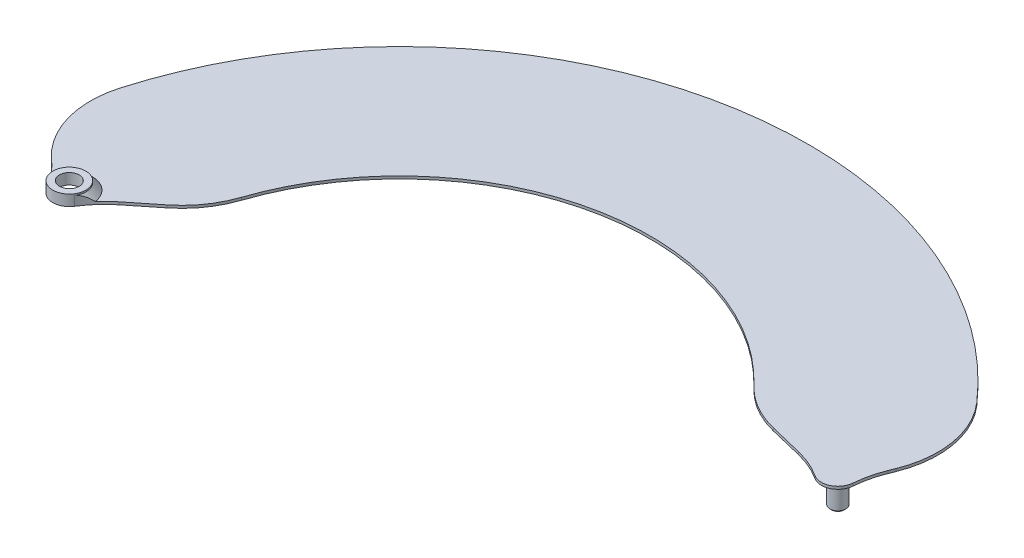
ISO-10303-21;
HEADER;
FILE_DESCRIPTION(('STEP AP214'),'2;1');
FILE_NAME('part.step','',(''),(''),'','','');
FILE_SCHEMA(('AUTOMOTIVE_DESIGN { 1 0 10303 214 1 1 1 1 }'));
ENDSEC;
DATA;
#1=APPLICATION_CONTEXT('core data for automotive mechanical design processes');
#2=APPLICATION_PROTOCOL_DEFINITION('international standard','automotive_design',2000,#1);
#3=PRODUCT_CONTEXT('',#1,'mechanical');
#4=PRODUCT('Part','Part','',(#3));
#5=PRODUCT_RELATED_PRODUCT_CATEGORY('part','',(#4));
#6=PRODUCT_DEFINITION_FORMATION('','',#4);
#7=PRODUCT_DEFINITION_CONTEXT('part definition',#1,'design');
#8=PRODUCT_DEFINITION('design','',#6,#7);
#9=PRODUCT_DEFINITION_SHAPE('','',#8);
#10=(LENGTH_UNIT() NAMED_UNIT(*) SI_UNIT(.MILLI.,.METRE.));
#11=(NAMED_UNIT(*) PLANE_ANGLE_UNIT() SI_UNIT($,.RADIAN.));
#12=(NAMED_UNIT(*) SI_UNIT($,.STERADIAN.) SOLID_ANGLE_UNIT());
#13=UNCERTAINTY_MEASURE_WITH_UNIT(LENGTH_MEASURE(1.E-05),#10,'distance_accuracy_value','');
#14=(GEOMETRIC_REPRESENTATION_CONTEXT(3) GLOBAL_UNCERTAINTY_ASSIGNED_CONTEXT((#13)) GLOBAL_UNIT_ASSIGNED_CONTEXT((#10,
#11,#12)) REPRESENTATION_CONTEXT('',''));
#15=CARTESIAN_POINT('',(0.,0.,0.));
#16=DIRECTION('',(0.,0.,1.));
#17=DIRECTION('',(1.,0.,0.));
#18=AXIS2_PLACEMENT_3D('',#15,#16,#17);
#19=CARTESIAN_POINT('',(22.6576946759163,0.2,-10.5654565435173));
#20=DIRECTION('',(0.,1.,0.));
#21=DIRECTION('',(0.,0.,1.));
#22=AXIS2_PLACEMENT_3D('',#19,#20,#21);
#23=PLANE('',#22);
#24=CARTESIAN_POINT('',(-64.638642589124,0.2,8.21403355419959));
#25=DIRECTION('',(0.,1.,0.));
#26=DIRECTION('',(0.,0.,1.));
#27=AXIS2_PLACEMENT_3D('',#24,#25,#26);
#28=CIRCLE('',#27,14.2857142857143);
#29=CARTESIAN_POINT('',(-54.8963953684509,0.2,-2.2344233531312));
#30=VERTEX_POINT('',#29);
#31=CARTESIAN_POINT('',(-53.4384139061172,0.2,-0.653689383590762));
#32=VERTEX_POINT('',#31);
#33=EDGE_CURVE('E212',#30,#32,#28,.F.);
#34=ORIENTED_EDGE('',*,*,#33,.T.);
#35=CARTESIAN_POINT('',(-50.,0.2,0.));
#36=DIRECTION('',(0.,1.,0.));
#37=DIRECTION('',(0.,0.,1.));
#38=AXIS2_PLACEMENT_3D('',#35,#36,#37);
#39=CIRCLE('',#38,3.49999999999995);
#40=CARTESIAN_POINT('',(-46.5336779208397,0.2,-0.484366848086781));
#41=VERTEX_POINT('',#40);
#42=EDGE_CURVE('E58',#32,#41,#39,.F.);
#43=ORIENTED_EDGE('',*,*,#42,.T.);
#44=CARTESIAN_POINT('',(-35.7815709382208,0.2,8.92168588870873));
#45=DIRECTION('',(0.,1.,0.));
#46=DIRECTION('',(0.,0.,1.));
#47=AXIS2_PLACEMENT_3D('',#44,#45,#46);
#48=CIRCLE('',#47,14.2857142857143);
#49=CARTESIAN_POINT('',(-44.7014335827453,0.2,-2.23706328204856));
#50=VERTEX_POINT('',#49);
#51=EDGE_CURVE('E216',#41,#50,#48,.F.);
#52=ORIENTED_EDGE('',*,*,#51,.T.);
#53=DIRECTION('',(0.781112441953009,0.,-0.624390385116721));
#54=VECTOR('',#53,1.);
#55=CARTESIAN_POINT('',(0.458755529096928,0.2,-38.3363319110118));
#56=LINE('',#55,#54);
#57=CARTESIAN_POINT('',(-40.6489307343633,0.2,-5.47647374113847));
#58=VERTEX_POINT('',#57);
#59=EDGE_CURVE('E375',#50,#58,#56,.T.);
#60=ORIENTED_EDGE('',*,*,#59,.T.);
#61=CARTESIAN_POINT('',(-49.5687933788879,0.2,-16.6352229118957));
#62=DIRECTION('',(0.,1.,0.));
#63=DIRECTION('',(0.,0.,1.));
#64=AXIS2_PLACEMENT_3D('',#61,#62,#63);
#65=CIRCLE('',#64,14.2857142857143);
#66=CARTESIAN_POINT('',(-36.0254072097929,0.2,-12.0900800397931));
#67=VERTEX_POINT('',#66);
#68=EDGE_CURVE('E405',#58,#67,#65,.T.);
#69=ORIENTED_EDGE('',*,*,#68,.T.);
#70=CARTESIAN_POINT('',(0.,0.2,0.));
#71=DIRECTION('',(0.,-1.,0.));
#72=DIRECTION('',(0.,0.,1.));
#73=AXIS2_PLACEMENT_3D('',#70,#71,#72);
#74=CIRCLE('',#73,38.);
#75=CARTESIAN_POINT('',(27.5406184746784,0.2,-26.1823286594642));
#76=VERTEX_POINT('',#75);
#77=EDGE_CURVE('E386',#67,#76,#74,.T.);
#78=ORIENTED_EDGE('',*,*,#77,.T.);
#79=CARTESIAN_POINT('',(37.8942344426026,0.2,-36.0253093585109));
#80=DIRECTION('',(0.,1.,0.));
#81=DIRECTION('',(0.,0.,1.));
#82=AXIS2_PLACEMENT_3D('',#79,#80,#81);
#83=CIRCLE('',#82,14.2857142857143);
#84=CARTESIAN_POINT('',(34.5259846463185,0.2,-22.1423512456701));
#85=VERTEX_POINT('',#84);
#86=EDGE_CURVE('E407',#76,#85,#83,.T.);
#87=ORIENTED_EDGE('',*,*,#86,.T.);
#88=DIRECTION('',(-0.971807067898858,0.,-0.23577748573989));
#89=VECTOR('',#88,1.);
#90=CARTESIAN_POINT('',(25.9700815661834,0.2,-24.218163804669));
#91=LINE('',#90,#89);
#92=CARTESIAN_POINT('',(39.5678335520805,0.2,-20.9191100306713));
#93=VERTEX_POINT('',#92);
#94=EDGE_CURVE('E380',#93,#85,#91,.T.);
#95=ORIENTED_EDGE('',*,*,#94,.F.);
#96=CARTESIAN_POINT('',(36.1995837557964,0.2,-7.03615191783045));
#97=DIRECTION('',(0.,1.,0.));
#98=DIRECTION('',(0.,0.,1.));
#99=AXIS2_PLACEMENT_3D('',#96,#97,#98);
#100=CIRCLE('',#99,14.2857142857143);
#101=CARTESIAN_POINT('',(43.9577161779549,0.2,-19.0316933384298));
#102=VERTEX_POINT('',#101);
#103=EDGE_CURVE('E199',#93,#102,#100,.F.);
#104=ORIENTED_EDGE('',*,*,#103,.T.);
#105=CARTESIAN_POINT('',(45.3153893518326,0.2,-21.1309130870347));
#106=DIRECTION('',(0.,1.,0.));
#107=DIRECTION('',(0.,0.,1.));
#108=AXIS2_PLACEMENT_3D('',#105,#106,#107);
#109=CIRCLE('',#108,2.50000000000001);
#110=CARTESIAN_POINT('',(47.8083598724512,0.2,-20.9435685292634));
#111=VERTEX_POINT('',#110);
#112=EDGE_CURVE('E415',#111,#102,#109,.F.);
#113=ORIENTED_EDGE('',*,*,#112,.F.);
#114=CARTESIAN_POINT('',(62.0539057045577,0.2,-19.8730281991421));
#115=DIRECTION('',(0.,1.,0.));
#116=DIRECTION('',(0.,0.,1.));
#117=AXIS2_PLACEMENT_3D('',#114,#115,#116);
#118=CIRCLE('',#117,14.2857142857143);
#119=CARTESIAN_POINT('',(48.8087224891767,0.2,-25.2252944709239));
#120=VERTEX_POINT('',#119);
#121=EDGE_CURVE('E200',#111,#120,#118,.F.);
#122=ORIENTED_EDGE('',*,*,#121,.T.);
#123=DIRECTION('',(0.374658639024727,0.,-0.927162825076663));
#124=VECTOR('',#123,1.);
#125=CARTESIAN_POINT('',(40.0455448781668,0.2,-3.5391736553932));
#126=LINE('',#125,#124);
#127=CARTESIAN_POINT('',(49.1506503034018,0.2,-26.0714587527204));
#128=VERTEX_POINT('',#127);
#129=EDGE_CURVE('E177',#120,#128,#126,.T.);
#130=ORIENTED_EDGE('',*,*,#129,.T.);
#131=CARTESIAN_POINT('',(35.9054670880209,0.2,-31.4237250245022));
#132=DIRECTION('',(0.,1.,0.));
#133=DIRECTION('',(0.,0.,1.));
#134=AXIS2_PLACEMENT_3D('',#131,#132,#133);
#135=CIRCLE('',#134,14.2857142857143);
#136=CARTESIAN_POINT('',(46.6556069347338,0.2,-40.8320259300419));
#137=VERTEX_POINT('',#136);
#138=EDGE_CURVE('E410',#128,#137,#135,.T.);
#139=ORIENTED_EDGE('',*,*,#138,.T.);
#140=CARTESIAN_POINT('',(0.,0.2,0.));
#141=DIRECTION('',(0.,1.,0.));
#142=DIRECTION('',(0.,0.,1.));
#143=AXIS2_PLACEMENT_3D('',#140,#141,#142);
#144=CIRCLE('',#143,61.9999999999999);
#145=CARTESIAN_POINT('',(-59.5406996957757,0.2,-17.2888715576652));
#146=VERTEX_POINT('',#145);
#147=EDGE_CURVE('E384',#137,#146,#144,.T.);
#148=ORIENTED_EDGE('',*,*,#147,.T.);
#149=CARTESIAN_POINT('',(-45.8216444663343,0.2,-13.3052605996778));
#150=DIRECTION('',(0.,1.,0.));
#151=DIRECTION('',(0.,0.,1.));
#152=AXIS2_PLACEMENT_3D('',#149,#150,#151);
#153=CIRCLE('',#152,14.2857142857143);
#154=CARTESIAN_POINT('',(-55.5638916870074,0.2,-2.85680369234704));
#155=VERTEX_POINT('',#154);
#156=EDGE_CURVE('E374',#146,#155,#153,.T.);
#157=ORIENTED_EDGE('',*,*,#156,.T.);
#158=DIRECTION('',(-0.731391983513155,0.,-0.681957305447118));
#159=VECTOR('',#158,1.);
#160=CARTESIAN_POINT('',(-17.5653946103506,0.2,32.573380479163));
#161=LINE('',#160,#159);
#162=EDGE_CURVE('E372',#30,#155,#161,.T.);
#163=ORIENTED_EDGE('',*,*,#162,.F.);
#164=EDGE_LOOP('',(#34,#43,#52,#60,#69,#78,#87,#95,#104,#113,#122,#130,#139,#148,#157,#163));
#165=FACE_BOUND('',#164,.T.);
#166=ADVANCED_FACE('F41',(#165),#23,.T.);
#167=CARTESIAN_POINT('',(0.,0.2,0.));
#168=DIRECTION('',(0.,-1.,0.));
#169=DIRECTION('',(0.,0.,-1.));
#170=AXIS2_PLACEMENT_3D('',#167,#168,#169);
#171=CYLINDRICAL_SURFACE('',#170,61.9999999999999);
#172=ORIENTED_EDGE('',*,*,#147,.F.);
#173=DIRECTION('',(0.,-1.,0.));
#174=VECTOR('',#173,1.);
#175=CARTESIAN_POINT('',(46.6556069347338,0.2,-40.8320259300419));
#176=LINE('',#175,#174);
#177=CARTESIAN_POINT('',(46.6556069347338,-0.2,-40.8320259300419));
#178=VERTEX_POINT('',#177);
#179=EDGE_CURVE('E318',#137,#178,#176,.T.);
#180=ORIENTED_EDGE('',*,*,#179,.T.);
#181=CARTESIAN_POINT('',(0.,-0.2,0.));
#182=DIRECTION('',(0.,1.,0.));
#183=DIRECTION('',(0.,0.,1.));
#184=AXIS2_PLACEMENT_3D('',#181,#182,#183);
#185=CIRCLE('',#184,61.9999999999999);
#186=CARTESIAN_POINT('',(-59.5406996957757,-0.2,-17.2888715576652));
#187=VERTEX_POINT('',#186);
#188=EDGE_CURVE('E378',#178,#187,#185,.T.);
#189=ORIENTED_EDGE('',*,*,#188,.T.);
#190=DIRECTION('',(0.,-1.,0.));
#191=VECTOR('',#190,1.);
#192=CARTESIAN_POINT('',(-59.5406996957757,0.2,-17.2888715576652));
#193=LINE('',#192,#191);
#194=EDGE_CURVE('E314',#187,#146,#193,.F.);
#195=ORIENTED_EDGE('',*,*,#194,.T.);
#196=EDGE_LOOP('',(#172,#180,#189,#195));
#197=FACE_BOUND('',#196,.T.);
#198=ADVANCED_FACE('F266',(#197),#171,.T.);
#199=CARTESIAN_POINT('',(0.,0.2,0.));
#200=DIRECTION('',(0.,-1.,0.));
#201=DIRECTION('',(0.,0.,-1.));
#202=AXIS2_PLACEMENT_3D('',#199,#200,#201);
#203=CYLINDRICAL_SURFACE('',#202,38.);
#204=CARTESIAN_POINT('',(0.,-0.2,0.));
#205=DIRECTION('',(0.,-1.,0.));
#206=DIRECTION('',(0.,0.,1.));
#207=AXIS2_PLACEMENT_3D('',#204,#205,#206);
#208=CIRCLE('',#207,38.);
#209=CARTESIAN_POINT('',(-36.0254072097929,-0.2,-12.0900800397931));
#210=VERTEX_POINT('',#209);
#211=CARTESIAN_POINT('',(27.5406184746784,-0.2,-26.1823286594642));
#212=VERTEX_POINT('',#211);
#213=EDGE_CURVE('E387',#210,#212,#208,.T.);
#214=ORIENTED_EDGE('',*,*,#213,.T.);
#215=DIRECTION('',(0.,-1.,0.));
#216=VECTOR('',#215,1.);
#217=CARTESIAN_POINT('',(27.5406184746784,0.2,-26.1823286594642));
#218=LINE('',#217,#216);
#219=EDGE_CURVE('E341',#212,#76,#218,.F.);
#220=ORIENTED_EDGE('',*,*,#219,.T.);
#221=ORIENTED_EDGE('',*,*,#77,.F.);
#222=DIRECTION('',(0.,-1.,0.));
#223=VECTOR('',#222,1.);
#224=CARTESIAN_POINT('',(-36.0254072097929,0.2,-12.0900800397931));
#225=LINE('',#224,#223);
#226=EDGE_CURVE('E339',#67,#210,#225,.T.);
#227=ORIENTED_EDGE('',*,*,#226,.T.);
#228=EDGE_LOOP('',(#214,#220,#221,#227));
#229=FACE_BOUND('',#228,.T.);
#230=ADVANCED_FACE('F271',(#229),#203,.F.);
#231=CARTESIAN_POINT('',(22.6576946759163,-0.2,-10.5654565435173));
#232=DIRECTION('',(0.,1.,0.));
#233=DIRECTION('',(0.,0.,1.));
#234=AXIS2_PLACEMENT_3D('',#231,#232,#233);
#235=PLANE('',#234);
#236=CARTESIAN_POINT('',(45.3153893518326,-0.2,-21.1309130870347));
#237=DIRECTION('',(0.,1.,0.));
#238=DIRECTION('',(0.,0.,1.));
#239=AXIS2_PLACEMENT_3D('',#236,#237,#238);
#240=CIRCLE('',#239,1.95);
#241=CARTESIAN_POINT('',(45.3153893518326,-0.2,-19.1809130870347));
#242=VERTEX_POINT('',#241);
#243=EDGE_CURVE('E473',#242,#242,#240,.T.);
#244=ORIENTED_EDGE('',*,*,#243,.T.);
#245=EDGE_LOOP('',(#244));
#246=FACE_BOUND('',#245,.T.);
#247=CARTESIAN_POINT('',(-50.,-0.2,0.));
#248=DIRECTION('',(0.,1.,0.));
#249=DIRECTION('',(0.,0.,1.));
#250=AXIS2_PLACEMENT_3D('',#247,#248,#249);
#251=CIRCLE('',#250,1.5);
#252=CARTESIAN_POINT('',(-50.,-0.2,1.50000000000001));
#253=VERTEX_POINT('',#252);
#254=EDGE_CURVE('E434',#253,#253,#251,.F.);
#255=ORIENTED_EDGE('',*,*,#254,.F.);
#256=EDGE_LOOP('',(#255));
#257=FACE_BOUND('',#256,.T.);
#258=ORIENTED_EDGE('',*,*,#188,.F.);
#259=CARTESIAN_POINT('',(35.9054670880209,-0.2,-31.4237250245022));
#260=DIRECTION('',(0.,1.,0.));
#261=DIRECTION('',(0.,0.,1.));
#262=AXIS2_PLACEMENT_3D('',#259,#260,#261);
#263=CIRCLE('',#262,14.2857142857143);
#264=CARTESIAN_POINT('',(49.1506503034018,-0.2,-26.0714587527204));
#265=VERTEX_POINT('',#264);
#266=EDGE_CURVE('E190',#178,#265,#263,.F.);
#267=ORIENTED_EDGE('',*,*,#266,.T.);
#268=DIRECTION('',(0.374658639024727,0.,-0.927162825076663));
#269=VECTOR('',#268,1.);
#270=CARTESIAN_POINT('',(40.0455448781668,-0.2,-3.5391736553932));
#271=LINE('',#270,#269);
#272=CARTESIAN_POINT('',(48.8087224891767,-0.2,-25.2252944709239));
#273=VERTEX_POINT('',#272);
#274=EDGE_CURVE('E174',#273,#265,#271,.T.);
#275=ORIENTED_EDGE('',*,*,#274,.F.);
#276=CARTESIAN_POINT('',(62.0539057045577,-0.2,-19.8730281991421));
#277=DIRECTION('',(0.,1.,0.));
#278=DIRECTION('',(0.,0.,1.));
#279=AXIS2_PLACEMENT_3D('',#276,#277,#278);
#280=CIRCLE('',#279,14.2857142857143);
#281=CARTESIAN_POINT('',(47.8083598724512,-0.2,-20.9435685292634));
#282=VERTEX_POINT('',#281);
#283=EDGE_CURVE('E187',#273,#282,#280,.T.);
#284=ORIENTED_EDGE('',*,*,#283,.T.);
#285=CARTESIAN_POINT('',(45.3153893518326,-0.2,-21.1309130870347));
#286=DIRECTION('',(0.,1.,0.));
#287=DIRECTION('',(0.,0.,1.));
#288=AXIS2_PLACEMENT_3D('',#285,#286,#287);
#289=CIRCLE('',#288,2.50000000000001);
#290=CARTESIAN_POINT('',(43.9577161779549,-0.2,-19.0316933384298));
#291=VERTEX_POINT('',#290);
#292=EDGE_CURVE('E391',#282,#291,#289,.F.);
#293=ORIENTED_EDGE('',*,*,#292,.T.);
#294=CARTESIAN_POINT('',(36.1995837557964,-0.2,-7.03615191783045));
#295=DIRECTION('',(0.,1.,0.));
#296=DIRECTION('',(0.,0.,1.));
#297=AXIS2_PLACEMENT_3D('',#294,#295,#296);
#298=CIRCLE('',#297,14.2857142857143);
#299=CARTESIAN_POINT('',(39.5678335520805,-0.2,-20.9191100306713));
#300=VERTEX_POINT('',#299);
#301=EDGE_CURVE('E204',#291,#300,#298,.T.);
#302=ORIENTED_EDGE('',*,*,#301,.T.);
#303=DIRECTION('',(-0.971807067898858,0.,-0.23577748573989));
#304=VECTOR('',#303,1.);
#305=CARTESIAN_POINT('',(25.9700815661834,-0.2,-24.218163804669));
#306=LINE('',#305,#304);
#307=CARTESIAN_POINT('',(34.5259846463185,-0.2,-22.1423512456701));
#308=VERTEX_POINT('',#307);
#309=EDGE_CURVE('E192',#300,#308,#306,.T.);
#310=ORIENTED_EDGE('',*,*,#309,.T.);
#311=CARTESIAN_POINT('',(37.8942344426026,-0.2,-36.0253093585109));
#312=DIRECTION('',(0.,1.,0.));
#313=DIRECTION('',(0.,0.,1.));
#314=AXIS2_PLACEMENT_3D('',#311,#312,#313);
#315=CIRCLE('',#314,14.2857142857143);
#316=EDGE_CURVE('E320',#308,#212,#315,.F.);
#317=ORIENTED_EDGE('',*,*,#316,.T.);
#318=ORIENTED_EDGE('',*,*,#213,.F.);
#319=CARTESIAN_POINT('',(-49.5687933788879,-0.2,-16.6352229118957));
#320=DIRECTION('',(0.,1.,0.));
#321=DIRECTION('',(0.,0.,1.));
#322=AXIS2_PLACEMENT_3D('',#319,#320,#321);
#323=CIRCLE('',#322,14.2857142857143);
#324=CARTESIAN_POINT('',(-40.6489307343633,-0.2,-5.47647374113847));
#325=VERTEX_POINT('',#324);
#326=EDGE_CURVE('E317',#210,#325,#323,.F.);
#327=ORIENTED_EDGE('',*,*,#326,.T.);
#328=DIRECTION('',(0.781112441953009,0.,-0.624390385116721));
#329=VECTOR('',#328,1.);
#330=CARTESIAN_POINT('',(0.458755529096928,-0.2,-38.3363319110118));
#331=LINE('',#330,#329);
#332=CARTESIAN_POINT('',(-44.7014335827453,-0.2,-2.23706328204856));
#333=VERTEX_POINT('',#332);
#334=EDGE_CURVE('E181',#333,#325,#331,.T.);
#335=ORIENTED_EDGE('',*,*,#334,.F.);
#336=CARTESIAN_POINT('',(-35.7815709382208,-0.2,8.92168588870873));
#337=DIRECTION('',(0.,1.,0.));
#338=DIRECTION('',(0.,0.,1.));
#339=AXIS2_PLACEMENT_3D('',#336,#337,#338);
#340=CIRCLE('',#339,14.2857142857143);
#341=CARTESIAN_POINT('',(-47.8823616290967,-0.2,1.32876172810556));
#342=VERTEX_POINT('',#341);
#343=EDGE_CURVE('E218',#333,#342,#340,.T.);
#344=ORIENTED_EDGE('',*,*,#343,.T.);
#345=CARTESIAN_POINT('',(-50.,-0.2,0.));
#346=DIRECTION('',(0.,1.,0.));
#347=DIRECTION('',(0.,0.,1.));
#348=AXIS2_PLACEMENT_3D('',#345,#346,#347);
#349=CIRCLE('',#348,2.5);
#350=CARTESIAN_POINT('',(-52.1802233643376,-0.2,1.22336669956165));
#351=VERTEX_POINT('',#350);
#352=EDGE_CURVE('E360',#351,#342,#349,.T.);
#353=ORIENTED_EDGE('',*,*,#352,.F.);
#354=CARTESIAN_POINT('',(-64.638642589124,-0.2,8.21403355419959));
#355=DIRECTION('',(0.,1.,0.));
#356=DIRECTION('',(0.,0.,1.));
#357=AXIS2_PLACEMENT_3D('',#354,#355,#356);
#358=CIRCLE('',#357,14.2857142857143);
#359=CARTESIAN_POINT('',(-54.8963953684509,-0.2,-2.2344233531312));
#360=VERTEX_POINT('',#359);
#361=EDGE_CURVE('E214',#351,#360,#358,.T.);
#362=ORIENTED_EDGE('',*,*,#361,.T.);
#363=DIRECTION('',(-0.731391983513155,0.,-0.681957305447118));
#364=VECTOR('',#363,1.);
#365=CARTESIAN_POINT('',(-17.5653946103506,-0.2,32.573380479163));
#366=LINE('',#365,#364);
#367=CARTESIAN_POINT('',(-55.5638916870074,-0.2,-2.85680369234704));
#368=VERTEX_POINT('',#367);
#369=EDGE_CURVE('E191',#360,#368,#366,.T.);
#370=ORIENTED_EDGE('',*,*,#369,.T.);
#371=CARTESIAN_POINT('',(-45.8216444663343,-0.2,-13.3052605996778));
#372=DIRECTION('',(0.,1.,0.));
#373=DIRECTION('',(0.,0.,1.));
#374=AXIS2_PLACEMENT_3D('',#371,#372,#373);
#375=CIRCLE('',#374,14.2857142857143);
#376=EDGE_CURVE('E311',#368,#187,#375,.F.);
#377=ORIENTED_EDGE('',*,*,#376,.T.);
#378=EDGE_LOOP('',(#258,#267,#275,#284,#293,#302,#310,#317,#318,#327,#335,#344,#353,#362,#370,#377));
#379=FACE_BOUND('',#378,.T.);
#380=ADVANCED_FACE('F185',(#246,#257,#379),#235,.F.);
#381=CARTESIAN_POINT('',(45.3153893518326,-4.2,-21.1309130870347));
#382=DIRECTION('',(0.,1.,0.));
#383=DIRECTION('',(0.,0.,1.));
#384=AXIS2_PLACEMENT_3D('',#381,#382,#383);
#385=CYLINDRICAL_SURFACE('',#384,1.2);
#386=CARTESIAN_POINT('',(45.3153893518326,-3.95000000000001,-21.1309130870347));
#387=DIRECTION('',(0.,-1.,0.));
#388=DIRECTION('',(0.,0.,-1.));
#389=AXIS2_PLACEMENT_3D('',#386,#387,#388);
#390=CIRCLE('',#389,1.2);
#391=CARTESIAN_POINT('',(45.3153893518326,-3.95000000000001,-22.3309130870347));
#392=VERTEX_POINT('',#391);
#393=EDGE_CURVE('E11',#392,#392,#390,.F.);
#394=ORIENTED_EDGE('',*,*,#393,.T.);
#395=EDGE_LOOP('',(#394));
#396=FACE_BOUND('',#395,.T.);
#397=CARTESIAN_POINT('',(45.3153893518326,-0.95,-21.1309130870347));
#398=DIRECTION('',(0.,1.,0.));
#399=DIRECTION('',(0.,0.,1.));
#400=AXIS2_PLACEMENT_3D('',#397,#398,#399);
#401=CIRCLE('',#400,1.2);
#402=CARTESIAN_POINT('',(45.3153893518326,-0.95,-19.9309130870347));
#403=VERTEX_POINT('',#402);
#404=EDGE_CURVE('E476',#403,#403,#401,.F.);
#405=ORIENTED_EDGE('',*,*,#404,.T.);
#406=EDGE_LOOP('',(#405));
#407=FACE_BOUND('',#406,.T.);
#408=ADVANCED_FACE('F276',(#396,#407),#385,.T.);
#409=CARTESIAN_POINT('',(0.,-4.2,0.));
#410=DIRECTION('',(0.,-1.,0.));
#411=DIRECTION('',(0.,0.,-1.));
#412=AXIS2_PLACEMENT_3D('',#409,#410,#411);
#413=PLANE('',#412);
#414=CARTESIAN_POINT('',(45.3153893518326,-4.2,-21.1309130870347));
#415=DIRECTION('',(0.,-1.,0.));
#416=DIRECTION('',(0.,0.,-1.));
#417=AXIS2_PLACEMENT_3D('',#414,#415,#416);
#418=CIRCLE('',#417,0.950000000000006);
#419=CARTESIAN_POINT('',(45.3153893518326,-4.2,-22.0809130870347));
#420=VERTEX_POINT('',#419);
#421=EDGE_CURVE('E51',#420,#420,#418,.T.);
#422=ORIENTED_EDGE('',*,*,#421,.T.);
#423=EDGE_LOOP('',(#422));
#424=FACE_BOUND('',#423,.T.);
#425=ADVANCED_FACE('F463',(#424),#413,.T.);
#426=CARTESIAN_POINT('',(33.194986749751,-4.2,13.4138127864188));
#427=DIRECTION('',(0.927162825076663,0.,0.374658639024727));
#428=DIRECTION('',(0.374658639024727,0.,-0.927162825076663));
#429=AXIS2_PLACEMENT_3D('',#426,#427,#428);
#430=PLANE('',#429);
#431=ORIENTED_EDGE('',*,*,#274,.T.);
#432=DIRECTION('',(0.,1.,0.));
#433=VECTOR('',#432,1.);
#434=CARTESIAN_POINT('',(49.1506503034018,0.2,-26.0714587527204));
#435=LINE('',#434,#433);
#436=EDGE_CURVE('E180',#265,#128,#435,.T.);
#437=ORIENTED_EDGE('',*,*,#436,.T.);
#438=ORIENTED_EDGE('',*,*,#129,.F.);
#439=DIRECTION('',(0.,1.,0.));
#440=VECTOR('',#439,1.);
#441=CARTESIAN_POINT('',(48.8087224891768,-4.2,-25.2252944709239));
#442=LINE('',#441,#440);
#443=EDGE_CURVE('E170',#120,#273,#442,.F.);
#444=ORIENTED_EDGE('',*,*,#443,.T.);
#445=EDGE_LOOP('',(#431,#437,#438,#444));
#446=FACE_BOUND('',#445,.T.);
#447=ADVANCED_FACE('F172',(#446),#430,.T.);
#448=CARTESIAN_POINT('',(6.99281676834165,-4.2,-28.8223819957647));
#449=DIRECTION('',(0.23577748573989,0.,-0.971807067898858));
#450=DIRECTION('',(-0.971807067898858,0.,-0.23577748573989));
#451=AXIS2_PLACEMENT_3D('',#448,#449,#450);
#452=PLANE('',#451);
#453=ORIENTED_EDGE('',*,*,#309,.F.);
#454=DIRECTION('',(0.,-1.,0.));
#455=VECTOR('',#454,1.);
#456=CARTESIAN_POINT('',(39.5678335520805,0.2,-20.9191100306713));
#457=LINE('',#456,#455);
#458=EDGE_CURVE('E335',#300,#93,#457,.F.);
#459=ORIENTED_EDGE('',*,*,#458,.T.);
#460=ORIENTED_EDGE('',*,*,#94,.T.);
#461=DIRECTION('',(0.,-1.,0.));
#462=VECTOR('',#461,1.);
#463=CARTESIAN_POINT('',(34.5259846463185,-4.2,-22.1423512456701));
#464=LINE('',#463,#462);
#465=EDGE_CURVE('E333',#85,#308,#464,.T.);
#466=ORIENTED_EDGE('',*,*,#465,.T.);
#467=EDGE_LOOP('',(#453,#459,#460,#466));
#468=FACE_BOUND('',#467,.T.);
#469=ADVANCED_FACE('F425',(#468),#452,.F.);
#470=CARTESIAN_POINT('',(45.3153893518326,-4.2,-21.1309130870347));
#471=DIRECTION('',(0.,1.,0.));
#472=DIRECTION('',(0.,0.,1.));
#473=AXIS2_PLACEMENT_3D('',#470,#471,#472);
#474=CYLINDRICAL_SURFACE('',#473,2.50000000000001);
#475=ORIENTED_EDGE('',*,*,#292,.F.);
#476=DIRECTION('',(0.,1.,0.));
#477=VECTOR('',#476,1.);
#478=CARTESIAN_POINT('',(47.8083598724512,-4.2,-20.9435685292634));
#479=LINE('',#478,#477);
#480=EDGE_CURVE('E197',#282,#111,#479,.T.);
#481=ORIENTED_EDGE('',*,*,#480,.T.);
#482=ORIENTED_EDGE('',*,*,#112,.T.);
#483=DIRECTION('',(0.,1.,0.));
#484=VECTOR('',#483,1.);
#485=CARTESIAN_POINT('',(43.9577161779549,-4.2,-19.0316933384298));
#486=LINE('',#485,#484);
#487=EDGE_CURVE('E328',#102,#291,#486,.F.);
#488=ORIENTED_EDGE('',*,*,#487,.T.);
#489=EDGE_LOOP('',(#475,#481,#482,#488));
#490=FACE_BOUND('',#489,.T.);
#491=ADVANCED_FACE('F417',(#490),#474,.T.);
#492=CARTESIAN_POINT('',(-50.,-4.2,0.));
#493=DIRECTION('',(0.,1.,0.));
#494=DIRECTION('',(0.,0.,1.));
#495=AXIS2_PLACEMENT_3D('',#492,#493,#494);
#496=CYLINDRICAL_SURFACE('',#495,2.5);
#497=CARTESIAN_POINT('',(-50.,1.19999999999996,0.));
#498=DIRECTION('',(0.,1.,0.));
#499=DIRECTION('',(0.,0.,1.));
#500=AXIS2_PLACEMENT_3D('',#497,#498,#499);
#501=CIRCLE('',#500,2.5);
#502=CARTESIAN_POINT('',(-47.8823616290967,1.19999999999996,1.32876172810556));
#503=VERTEX_POINT('',#502);
#504=CARTESIAN_POINT('',(-52.1802233643376,1.19999999999996,1.22336669956165));
#505=VERTEX_POINT('',#504);
#506=EDGE_CURVE('E220',#503,#505,#501,.T.);
#507=ORIENTED_EDGE('',*,*,#506,.T.);
#508=DIRECTION('',(0.,1.,0.));
#509=VECTOR('',#508,1.);
#510=CARTESIAN_POINT('',(-52.1802233643376,-4.2,1.22336669956165));
#511=LINE('',#510,#509);
#512=EDGE_CURVE('E206',#505,#351,#511,.F.);
#513=ORIENTED_EDGE('',*,*,#512,.T.);
#514=ORIENTED_EDGE('',*,*,#352,.T.);
#515=DIRECTION('',(0.,1.,0.));
#516=VECTOR('',#515,1.);
#517=CARTESIAN_POINT('',(-47.8823616290967,-4.2,1.32876172810556));
#518=LINE('',#517,#516);
#519=EDGE_CURVE('E354',#342,#503,#518,.T.);
#520=ORIENTED_EDGE('',*,*,#519,.T.);
#521=EDGE_LOOP('',(#507,#513,#514,#520));
#522=FACE_BOUND('',#521,.T.);
#523=CARTESIAN_POINT('',(-50.,1.45,0.));
#524=DIRECTION('',(0.,1.,0.));
#525=DIRECTION('',(0.,0.,1.));
#526=AXIS2_PLACEMENT_3D('',#523,#524,#525);
#527=CIRCLE('',#526,2.5);
#528=CARTESIAN_POINT('',(-50.,1.45,2.50000000000001));
#529=VERTEX_POINT('',#528);
#530=EDGE_CURVE('E429',#529,#529,#527,.T.);
#531=ORIENTED_EDGE('',*,*,#530,.F.);
#532=EDGE_LOOP('',(#531));
#533=FACE_BOUND('',#532,.T.);
#534=ADVANCED_FACE('F358',(#522,#533),#496,.T.);
#535=CARTESIAN_POINT('',(-18.5185092687448,-4.2,-23.1666571763988));
#536=DIRECTION('',(0.624390385116721,0.,0.781112441953009));
#537=DIRECTION('',(0.781112441953009,0.,-0.624390385116721));
#538=AXIS2_PLACEMENT_3D('',#535,#536,#537);
#539=PLANE('',#538);
#540=ORIENTED_EDGE('',*,*,#334,.T.);
#541=DIRECTION('',(0.,1.,0.));
#542=VECTOR('',#541,1.);
#543=CARTESIAN_POINT('',(-40.6489307343633,0.2,-5.47647374113846));
#544=LINE('',#543,#542);
#545=EDGE_CURVE('E347',#325,#58,#544,.T.);
#546=ORIENTED_EDGE('',*,*,#545,.T.);
#547=ORIENTED_EDGE('',*,*,#59,.F.);
#548=DIRECTION('',(0.,-1.,0.));
#549=VECTOR('',#548,1.);
#550=CARTESIAN_POINT('',(-44.7014335827453,-0.2,-2.23706328204854));
#551=LINE('',#550,#549);
#552=EDGE_CURVE('E345',#50,#333,#551,.T.);
#553=ORIENTED_EDGE('',*,*,#552,.T.);
#554=EDGE_LOOP('',(#540,#546,#547,#553));
#555=FACE_BOUND('',#554,.T.);
#556=ADVANCED_FACE('F449',(#555),#539,.T.);
#557=CARTESIAN_POINT('',(-24.4159527387664,-4.2,26.1858505808683));
#558=DIRECTION('',(0.681957305447118,0.,-0.731391983513155));
#559=DIRECTION('',(-0.731391983513155,0.,-0.681957305447118));
#560=AXIS2_PLACEMENT_3D('',#557,#558,#559);
#561=PLANE('',#560);
#562=ORIENTED_EDGE('',*,*,#162,.T.);
#563=DIRECTION('',(0.,-1.,0.));
#564=VECTOR('',#563,1.);
#565=CARTESIAN_POINT('',(-55.5638916870074,-4.2,-2.85680369234704));
#566=LINE('',#565,#564);
#567=EDGE_CURVE('E312',#155,#368,#566,.T.);
#568=ORIENTED_EDGE('',*,*,#567,.T.);
#569=ORIENTED_EDGE('',*,*,#369,.F.);
#570=DIRECTION('',(0.,1.,0.));
#571=VECTOR('',#570,1.);
#572=CARTESIAN_POINT('',(-54.8963953684509,-4.2,-2.23442335313119));
#573=LINE('',#572,#571);
#574=EDGE_CURVE('E350',#360,#30,#573,.T.);
#575=ORIENTED_EDGE('',*,*,#574,.T.);
#576=EDGE_LOOP('',(#562,#568,#569,#575));
#577=FACE_BOUND('',#576,.T.);
#578=ADVANCED_FACE('F287',(#577),#561,.F.);
#579=CARTESIAN_POINT('',(35.9054670880209,0.2,-31.4237250245022));
#580=DIRECTION('',(0.,-1.,0.));
#581=DIRECTION('',(0.,0.,-1.));
#582=AXIS2_PLACEMENT_3D('',#579,#580,#581);
#583=CYLINDRICAL_SURFACE('',#582,14.2857142857143);
#584=ORIENTED_EDGE('',*,*,#266,.F.);
#585=ORIENTED_EDGE('',*,*,#179,.F.);
#586=ORIENTED_EDGE('',*,*,#138,.F.);
#587=ORIENTED_EDGE('',*,*,#436,.F.);
#588=EDGE_LOOP('',(#584,#585,#586,#587));
#589=FACE_BOUND('',#588,.T.);
#590=ADVANCED_FACE('F284',(#589),#583,.T.);
#591=CARTESIAN_POINT('',(62.0539057045577,-4.2,-19.8730281991421));
#592=DIRECTION('',(0.,1.,0.));
#593=DIRECTION('',(0.,0.,1.));
#594=AXIS2_PLACEMENT_3D('',#591,#592,#593);
#595=CYLINDRICAL_SURFACE('',#594,14.2857142857143);
#596=ORIENTED_EDGE('',*,*,#283,.F.);
#597=ORIENTED_EDGE('',*,*,#443,.F.);
#598=ORIENTED_EDGE('',*,*,#121,.F.);
#599=ORIENTED_EDGE('',*,*,#480,.F.);
#600=EDGE_LOOP('',(#596,#597,#598,#599));
#601=FACE_BOUND('',#600,.T.);
#602=ADVANCED_FACE('F195',(#601),#595,.F.);
#603=CARTESIAN_POINT('',(36.1995837557964,-4.2,-7.03615191783045));
#604=DIRECTION('',(0.,1.,0.));
#605=DIRECTION('',(0.,0.,1.));
#606=AXIS2_PLACEMENT_3D('',#603,#604,#605);
#607=CYLINDRICAL_SURFACE('',#606,14.2857142857143);
#608=ORIENTED_EDGE('',*,*,#301,.F.);
#609=ORIENTED_EDGE('',*,*,#487,.F.);
#610=ORIENTED_EDGE('',*,*,#103,.F.);
#611=ORIENTED_EDGE('',*,*,#458,.F.);
#612=EDGE_LOOP('',(#608,#609,#610,#611));
#613=FACE_BOUND('',#612,.T.);
#614=ADVANCED_FACE('F291',(#613),#607,.F.);
#615=CARTESIAN_POINT('',(37.8942344426026,0.2,-36.0253093585109));
#616=DIRECTION('',(0.,-1.,0.));
#617=DIRECTION('',(0.,0.,-1.));
#618=AXIS2_PLACEMENT_3D('',#615,#616,#617);
#619=CYLINDRICAL_SURFACE('',#618,14.2857142857143);
#620=ORIENTED_EDGE('',*,*,#316,.F.);
#621=ORIENTED_EDGE('',*,*,#465,.F.);
#622=ORIENTED_EDGE('',*,*,#86,.F.);
#623=ORIENTED_EDGE('',*,*,#219,.F.);
#624=EDGE_LOOP('',(#620,#621,#622,#623));
#625=FACE_BOUND('',#624,.T.);
#626=ADVANCED_FACE('F294',(#625),#619,.T.);
#627=CARTESIAN_POINT('',(-49.5687933788879,0.2,-16.6352229118957));
#628=DIRECTION('',(0.,-1.,0.));
#629=DIRECTION('',(0.,0.,-1.));
#630=AXIS2_PLACEMENT_3D('',#627,#628,#629);
#631=CYLINDRICAL_SURFACE('',#630,14.2857142857143);
#632=ORIENTED_EDGE('',*,*,#326,.F.);
#633=ORIENTED_EDGE('',*,*,#226,.F.);
#634=ORIENTED_EDGE('',*,*,#68,.F.);
#635=ORIENTED_EDGE('',*,*,#545,.F.);
#636=EDGE_LOOP('',(#632,#633,#634,#635));
#637=FACE_BOUND('',#636,.T.);
#638=ADVANCED_FACE('F298',(#637),#631,.T.);
#639=CARTESIAN_POINT('',(-45.8216444663343,0.2,-13.3052605996778));
#640=DIRECTION('',(0.,-1.,0.));
#641=DIRECTION('',(0.,0.,-1.));
#642=AXIS2_PLACEMENT_3D('',#639,#640,#641);
#643=CYLINDRICAL_SURFACE('',#642,14.2857142857143);
#644=ORIENTED_EDGE('',*,*,#376,.F.);
#645=ORIENTED_EDGE('',*,*,#567,.F.);
#646=ORIENTED_EDGE('',*,*,#156,.F.);
#647=ORIENTED_EDGE('',*,*,#194,.F.);
#648=EDGE_LOOP('',(#644,#645,#646,#647));
#649=FACE_BOUND('',#648,.T.);
#650=ADVANCED_FACE('F301',(#649),#643,.T.);
#651=CARTESIAN_POINT('',(-64.638642589124,-4.2,8.21403355419959));
#652=DIRECTION('',(0.,1.,0.));
#653=DIRECTION('',(0.,0.,1.));
#654=AXIS2_PLACEMENT_3D('',#651,#652,#653);
#655=CYLINDRICAL_SURFACE('',#654,14.2857142857143);
#656=ORIENTED_EDGE('',*,*,#361,.F.);
#657=ORIENTED_EDGE('',*,*,#512,.F.);
#658=CARTESIAN_POINT('',(-52.1802233643376,1.19999999999996,1.22336669956165));
#659=CARTESIAN_POINT('',(-52.2109102471358,1.20004438994951,1.16866986460319));
#660=CARTESIAN_POINT('',(-52.2419513557316,1.19722809191498,1.11420180077255));
#661=CARTESIAN_POINT('',(-52.3044504431649,1.18622166263264,1.00617723401509));
#662=CARTESIAN_POINT('',(-52.335907593351,1.17804098584497,0.952619297094201));
#663=CARTESIAN_POINT('',(-52.3985950385618,1.15680749102021,0.847448768126859));
#664=CARTESIAN_POINT('',(-52.4298219249848,1.14382766284198,0.795819182062538));
#665=CARTESIAN_POINT('',(-52.4923459835084,1.11351302016176,0.693881436287621));
#666=CARTESIAN_POINT('',(-52.5236431818315,1.0961761525076,0.64357391194721));
#667=CARTESIAN_POINT('',(-52.6076679590147,1.04450890509314,0.510329057846734));
#668=CARTESIAN_POINT('',(-52.6603493932805,1.00668565820692,0.428714429094905));
#669=CARTESIAN_POINT('',(-52.7653299749327,0.92289050118341,0.269526522307979));
#670=CARTESIAN_POINT('',(-52.8176287577164,0.876911664668215,0.19195675252586));
#671=CARTESIAN_POINT('',(-52.922317100636,0.77846535376831,0.0398086476045606));
#672=CARTESIAN_POINT('',(-52.9747030876319,0.725942194070222,-0.0347356935823106));
#673=CARTESIAN_POINT('',(-53.0791827913203,0.61634618851567,-0.180521853982345));
#674=CARTESIAN_POINT('',(-53.1312766080433,0.559275016272676,-0.251764872918665));
#675=CARTESIAN_POINT('',(-53.2260632921599,0.452182707283742,-0.378974531776311));
#676=CARTESIAN_POINT('',(-53.2687761704327,0.402718993446145,-0.435399994279003));
#677=CARTESIAN_POINT('',(-53.3537852703137,0.302395491595565,-0.546013756555185));
#678=CARTESIAN_POINT('',(-53.3960815341801,0.251553787350882,-0.600218393139059));
#679=CARTESIAN_POINT('',(-53.4384139061172,0.199999999999998,-0.653689383590763));
#680=B_SPLINE_CURVE_WITH_KNOTS('',3,(#658,#659,#660,#661,#662,#663,#664,#665,#666,#667,#668,
#669,#670,#671,#672,#673,#674,#675,#676,#677,#678,#679),.UNSPECIFIED.,.F.,.F.,(4,2,2,2,2,2,2,2,
2,2,4),(0.,0.188044656247586,0.375758780377428,0.560728135465945,0.745784816974136,
1.05795406268214,1.37038970802644,1.6856932006659,2.00088119652974,2.25986878243241,
2.51635653575204),.UNSPECIFIED.);
#681=EDGE_CURVE('E66',#505,#32,#680,.T.);
#682=ORIENTED_EDGE('',*,*,#681,.T.);
#683=ORIENTED_EDGE('',*,*,#33,.F.);
#684=ORIENTED_EDGE('',*,*,#574,.F.);
#685=EDGE_LOOP('',(#656,#657,#682,#683,#684));
#686=FACE_BOUND('',#685,.T.);
#687=ADVANCED_FACE('F238',(#686),#655,.F.);
#688=CARTESIAN_POINT('',(-35.7815709382208,-4.2,8.92168588870873));
#689=DIRECTION('',(0.,1.,0.));
#690=DIRECTION('',(0.,0.,1.));
#691=AXIS2_PLACEMENT_3D('',#688,#689,#690);
#692=CYLINDRICAL_SURFACE('',#691,14.2857142857143);
#693=ORIENTED_EDGE('',*,*,#343,.F.);
#694=ORIENTED_EDGE('',*,*,#552,.F.);
#695=ORIENTED_EDGE('',*,*,#51,.F.);
#696=CARTESIAN_POINT('',(-46.5336779208397,0.2,-0.484366848086779));
#697=CARTESIAN_POINT('',(-46.5658609114974,0.236961089130419,-0.447577610674167));
#698=CARTESIAN_POINT('',(-46.5980437312601,0.273543740078591,-0.410409043257972));
#699=CARTESIAN_POINT('',(-46.6624477783336,0.345824921591148,-0.335236084797969));
#700=CARTESIAN_POINT('',(-46.6946690118913,0.381523279011297,-0.29723153277644));
#701=CARTESIAN_POINT('',(-46.7917077712929,0.487382923047459,-0.181538263189634));
#702=CARTESIAN_POINT('',(-46.856623430697,0.555987740005216,-0.102485896336209));
#703=CARTESIAN_POINT('',(-46.9891152138523,0.689622012272387,0.0625575281504819));
#704=CARTESIAN_POINT('',(-47.0567086610288,0.754459878811032,0.148691237270398));
#705=CARTESIAN_POINT('',(-47.1926355218268,0.875306054430576,0.326239170649622));
#706=CARTESIAN_POINT('',(-47.2609673106493,0.931330688641141,0.417643192659526));
#707=CARTESIAN_POINT('',(-47.3678546450358,1.00865414545829,0.564422369960992));
#708=CARTESIAN_POINT('',(-47.4061181289718,1.03430626640627,0.617713901628755));
#709=CARTESIAN_POINT('',(-47.4828593193936,1.08093535286449,0.726205597489429));
#710=CARTESIAN_POINT('',(-47.5213370728093,1.10191124929205,0.781406194809441));
#711=CARTESIAN_POINT('',(-47.5979493238027,1.13813815938584,0.893026642506231));
#712=CARTESIAN_POINT('',(-47.6360833620819,1.15344486764719,0.949428541676021));
#713=CARTESIAN_POINT('',(-47.7121231288442,1.17784828423933,1.06368006952949));
#714=CARTESIAN_POINT('',(-47.7500290197653,1.18695010679928,1.12152846509966));
#715=CARTESIAN_POINT('',(-47.8035309449178,1.19511735014689,1.20449909422501));
#716=CARTESIAN_POINT('',(-47.8193633428085,1.19694315064379,1.22921879260037));
#717=CARTESIAN_POINT('',(-47.8509429376919,1.1993865891532,1.2788618231556));
#718=CARTESIAN_POINT('',(-47.8666898091517,1.20000109556225,1.30378551631579));
#719=CARTESIAN_POINT('',(-47.8823616290967,1.19999999999996,1.32876172810556));
#720=B_SPLINE_CURVE_WITH_KNOTS('',3,(#696,#697,#698,#699,#700,#701,#702,#703,#704,#705,#706,
#707,#708,#709,#710,#711,#712,#713,#714,#715,#716,#717,#718,#719),.UNSPECIFIED.,.F.,.F.,(4,2,2,
2,2,2,2,2,2,2,2,4),(0.,0.183836714962588,0.367709145011331,0.737039081711373,1.11850631051329,
1.49925839243934,1.71043989700626,1.92166963267943,2.1307654288082,2.33968867366316,
2.42790304506482,2.51634518277314),.UNSPECIFIED.);
#721=EDGE_CURVE('E231',#41,#503,#720,.T.);
#722=ORIENTED_EDGE('',*,*,#721,.T.);
#723=ORIENTED_EDGE('',*,*,#519,.F.);
#724=EDGE_LOOP('',(#693,#694,#695,#722,#723));
#725=FACE_BOUND('',#724,.T.);
#726=ADVANCED_FACE('F250',(#725),#692,.F.);
#727=CARTESIAN_POINT('',(-50.,1.45,0.));
#728=DIRECTION('',(0.,1.,0.));
#729=DIRECTION('',(0.,0.,1.));
#730=AXIS2_PLACEMENT_3D('',#727,#728,#729);
#731=PLANE('',#730);
#732=CARTESIAN_POINT('',(-50.,1.45,0.));
#733=DIRECTION('',(0.,1.,0.));
#734=DIRECTION('',(0.,0.,1.));
#735=AXIS2_PLACEMENT_3D('',#732,#733,#734);
#736=CIRCLE('',#735,1.5);
#737=CARTESIAN_POINT('',(-50.,1.45,1.50000000000001));
#738=VERTEX_POINT('',#737);
#739=EDGE_CURVE('E437',#738,#738,#736,.F.);
#740=ORIENTED_EDGE('',*,*,#739,.T.);
#741=EDGE_LOOP('',(#740));
#742=FACE_BOUND('',#741,.T.);
#743=ORIENTED_EDGE('',*,*,#530,.T.);
#744=EDGE_LOOP('',(#743));
#745=FACE_BOUND('',#744,.T.);
#746=ADVANCED_FACE('F248',(#742,#745),#731,.T.);
#747=CARTESIAN_POINT('',(-50.,1.19999999999996,0.));
#748=DIRECTION('',(0.,-1.,0.));
#749=DIRECTION('',(0.,0.,-1.));
#750=AXIS2_PLACEMENT_3D('',#747,#748,#749);
#751=CONICAL_SURFACE('',#750,2.5,0.785398163397444);
#752=ORIENTED_EDGE('',*,*,#721,.F.);
#753=ORIENTED_EDGE('',*,*,#42,.F.);
#754=ORIENTED_EDGE('',*,*,#681,.F.);
#755=ORIENTED_EDGE('',*,*,#506,.F.);
#756=EDGE_LOOP('',(#752,#753,#754,#755));
#757=FACE_BOUND('',#756,.T.);
#758=ADVANCED_FACE('F242',(#757),#751,.T.);
#759=CARTESIAN_POINT('',(-50.,-4.201,0.));
#760=DIRECTION('',(0.,1.,0.));
#761=DIRECTION('',(0.,0.,1.));
#762=AXIS2_PLACEMENT_3D('',#759,#760,#761);
#763=CYLINDRICAL_SURFACE('',#762,1.5);
#764=ORIENTED_EDGE('',*,*,#739,.F.);
#765=EDGE_LOOP('',(#764));
#766=FACE_BOUND('',#765,.T.);
#767=ORIENTED_EDGE('',*,*,#254,.T.);
#768=EDGE_LOOP('',(#767));
#769=FACE_BOUND('',#768,.T.);
#770=ADVANCED_FACE('F247',(#766,#769),#763,.F.);
#771=CARTESIAN_POINT('',(45.3153893518326,-0.95,-21.1309130870347));
#772=DIRECTION('',(0.,1.,0.));
#773=DIRECTION('',(0.,0.,1.));
#774=AXIS2_PLACEMENT_3D('',#771,#772,#773);
#775=TOROIDAL_SURFACE('',#774,1.95,0.75);
#776=ORIENTED_EDGE('',*,*,#243,.F.);
#777=EDGE_LOOP('',(#776));
#778=FACE_BOUND('',#777,.T.);
#779=ORIENTED_EDGE('',*,*,#404,.F.);
#780=EDGE_LOOP('',(#779));
#781=FACE_BOUND('',#780,.T.);
#782=ADVANCED_FACE('F252',(#778,#781),#775,.F.);
#783=CARTESIAN_POINT('',(45.3153893518326,-4.2,-21.1309130870347));
#784=DIRECTION('',(0.,1.,0.));
#785=DIRECTION('',(0.,0.,1.));
#786=AXIS2_PLACEMENT_3D('',#783,#784,#785);
#787=CONICAL_SURFACE('',#786,0.950000000000006,0.785398163397457);
#788=ORIENTED_EDGE('',*,*,#393,.F.);
#789=EDGE_LOOP('',(#788));
#790=FACE_BOUND('',#789,.T.);
#791=ORIENTED_EDGE('',*,*,#421,.F.);
#792=EDGE_LOOP('',(#791));
#793=FACE_BOUND('',#792,.T.);
#794=ADVANCED_FACE('F44',(#790,#793),#787,.T.);
#795=CLOSED_SHELL('',(#166,#198,#230,#380,#408,#425,#447,#469,#491,#534,#556,#578,#590,#602,
#614,#626,#638,#650,#687,#726,#746,#758,#770,#782,#794));
#796=MANIFOLD_SOLID_BREP('B2',#795);
#797=ADVANCED_BREP_SHAPE_REPRESENTATION('',(#18,#796),#14);
#798=SHAPE_DEFINITION_REPRESENTATION(#9,#797);
ENDSEC;
END-ISO-10303-21;
